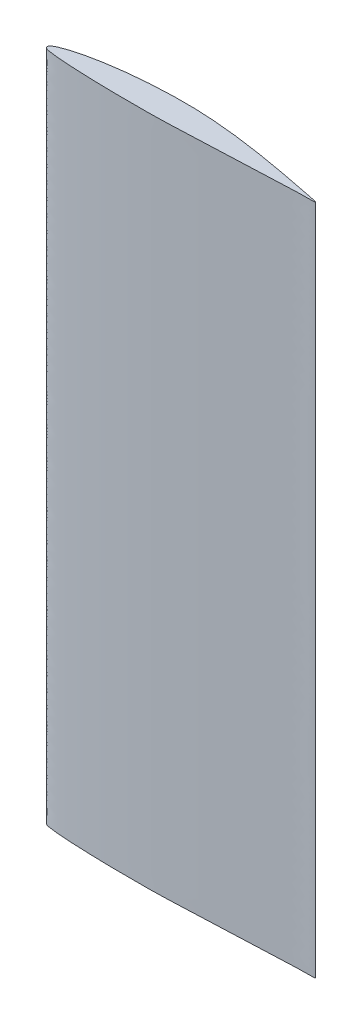
ISO-10303-21;
HEADER;
FILE_DESCRIPTION(('STEP AP214'),'2;1');
FILE_NAME('part.step','',(''),(''),'','','');
FILE_SCHEMA(('AUTOMOTIVE_DESIGN { 1 0 10303 214 1 1 1 1 }'));
ENDSEC;
DATA;
#1=APPLICATION_CONTEXT('core data for automotive mechanical design processes');
#2=APPLICATION_PROTOCOL_DEFINITION('international standard','automotive_design',2000,#1);
#3=PRODUCT_CONTEXT('',#1,'mechanical');
#4=PRODUCT('Part','Part','',(#3));
#5=PRODUCT_RELATED_PRODUCT_CATEGORY('part','',(#4));
#6=PRODUCT_DEFINITION_FORMATION('','',#4);
#7=PRODUCT_DEFINITION_CONTEXT('part definition',#1,'design');
#8=PRODUCT_DEFINITION('design','',#6,#7);
#9=PRODUCT_DEFINITION_SHAPE('','',#8);
#10=(LENGTH_UNIT() NAMED_UNIT(*) SI_UNIT(.MILLI.,.METRE.));
#11=(NAMED_UNIT(*) PLANE_ANGLE_UNIT() SI_UNIT($,.RADIAN.));
#12=(NAMED_UNIT(*) SI_UNIT($,.STERADIAN.) SOLID_ANGLE_UNIT());
#13=UNCERTAINTY_MEASURE_WITH_UNIT(LENGTH_MEASURE(1.E-05),#10,'distance_accuracy_value','');
#14=(GEOMETRIC_REPRESENTATION_CONTEXT(3) GLOBAL_UNCERTAINTY_ASSIGNED_CONTEXT((#13)) GLOBAL_UNIT_ASSIGNED_CONTEXT((#10,
#11,#12)) REPRESENTATION_CONTEXT('',''));
#15=CARTESIAN_POINT('',(0.,0.,0.));
#16=DIRECTION('',(0.,0.,1.));
#17=DIRECTION('',(1.,0.,0.));
#18=AXIS2_PLACEMENT_3D('',#15,#16,#17);
#19=CARTESIAN_POINT('',(100.,250.,0.));
#20=CARTESIAN_POINT('',(100.026927671132,250.,-0.219433857601069));
#21=CARTESIAN_POINT('',(94.2687190448547,250.,-1.18357603877327));
#22=CARTESIAN_POINT('',(90.2782919394899,250.,-2.08318901378914));
#23=CARTESIAN_POINT('',(85.041517129227,250.,-3.07989005572289));
#24=CARTESIAN_POINT('',(80.1264082453985,250.,-3.98275907273884));
#25=CARTESIAN_POINT('',(75.1120082774222,250.,-4.83259453247245));
#26=CARTESIAN_POINT('',(70.1110658354599,250.,-5.59956251336753));
#27=CARTESIAN_POINT('',(65.0940438797978,250.,-6.27264917857508));
#28=CARTESIAN_POINT('',(60.0707728010257,250.,-6.84345968217377));
#29=CARTESIAN_POINT('',(55.0395570271188,250.,-7.28990546178536));
#30=CARTESIAN_POINT('',(50.0026353208611,250.,-7.60018144206823));
#31=CARTESIAN_POINT('',(44.960674036922,250.,-7.72587288156002));
#32=CARTESIAN_POINT('',(39.9180143164161,250.,-7.69808521851061));
#33=CARTESIAN_POINT('',(34.8760374997964,250.,-7.51900318716417));
#34=CARTESIAN_POINT('',(29.8353494819684,250.,-7.21014032865744));
#35=CARTESIAN_POINT('',(24.7966077140941,250.,-6.76243725223212));
#36=CARTESIAN_POINT('',(19.7625076817131,250.,-6.15353517960491));
#37=CARTESIAN_POINT('',(14.7310618329927,250.,-5.37613055548835));
#38=CARTESIAN_POINT('',(9.70673162057761,250.,-4.36404729801727));
#39=CARTESIAN_POINT('',(5.52922086782099,250.,-3.27399749030539));
#40=CARTESIAN_POINT('',(2.65716322291705,250.,-2.20925264672238));
#41=CARTESIAN_POINT('',(1.26389952803015,250.,-1.57618033074622));
#42=CARTESIAN_POINT('',(0.635088126379829,250.,-1.14970261769804));
#43=CARTESIAN_POINT('',(0.180823596335757,250.,-0.758118253580851));
#44=CARTESIAN_POINT('',(-0.251357417409329,250.,0.0536982077151376));
#45=CARTESIAN_POINT('',(0.472849838761541,250.,0.563654735795677));
#46=CARTESIAN_POINT('',(1.00190869405862,250.,0.773847466142884));
#47=CARTESIAN_POINT('',(1.69451689374878,250.,0.954370998278404));
#48=CARTESIAN_POINT('',(3.13764553369681,250.,1.15291763324958));
#49=CARTESIAN_POINT('',(5.24459079259245,250.,1.38551365784962));
#50=CARTESIAN_POINT('',(7.75911696803287,250.,1.57850406170493));
#51=CARTESIAN_POINT('',(11.0916595399467,250.,1.79517691489934));
#52=CARTESIAN_POINT('',(15.2472114236061,250.,1.98319208588348));
#53=CARTESIAN_POINT('',(20.224881617593,250.,2.15684962290712));
#54=CARTESIAN_POINT('',(25.194649087253,250.,2.26881001014293));
#55=CARTESIAN_POINT('',(31.8122150760426,250.,2.35675664141578));
#56=CARTESIAN_POINT('',(38.4273418798502,250.,2.35472498491023));
#57=CARTESIAN_POINT('',(46.6975695156845,250.,2.21593206805948));
#58=CARTESIAN_POINT('',(53.3119366539603,250.,1.88296974154404));
#59=CARTESIAN_POINT('',(59.9356266936685,250.,1.62522224566525));
#60=CARTESIAN_POINT('',(64.9117703433052,250.,1.42126340895399));
#61=CARTESIAN_POINT('',(69.8977511827702,250.,1.22014608270236));
#62=CARTESIAN_POINT('',(74.8865230218986,250.,1.01702965608465));
#63=CARTESIAN_POINT('',(79.9087242718411,250.,0.816125999301938));
#64=CARTESIAN_POINT('',(84.8534896606434,250.,0.606576665018989));
#65=CARTESIAN_POINT('',(90.1377854676765,250.,0.426514526272728));
#66=CARTESIAN_POINT('',(94.1980625832089,250.,0.134726969093298));
#67=CARTESIAN_POINT('',(99.9733041124538,250.,0.217545050873828));
#68=CARTESIAN_POINT('',(100.,250.,0.));
#69=B_SPLINE_CURVE_WITH_KNOTS('',3,(#19,#20,#21,#22,#23,#24,#25,#26,#27,#28,#29,#30,#31,#32,#33,
#34,#35,#36,#37,#38,#39,#40,#41,#42,#43,#44,#45,#46,#47,#48,#49,#50,#51,#52,#53,#54,#55,#56,#57,
#58,#59,#60,#61,#62,#63,#64,#65,#66,#67,#68),.UNSPECIFIED.,.T.,.F.,(4,1,1,1,1,1,1,1,1,1,1,1,1,1,
1,1,1,1,1,1,1,1,1,1,1,1,1,1,1,1,1,1,1,1,1,1,1,1,1,1,1,1,1,1,1,1,1,4),(0.,0.0250986036707922,
0.0501103077754413,0.0751313716599332,0.100155101425005,0.125174498414434,0.150180025168701,
0.175165489812754,0.200126912172281,0.225061593791551,0.249970909716482,0.274861188741395,
0.299750368383722,0.324652268168195,0.34957928738967,0.374544440011454,0.399567460672877,
0.424676220232209,0.449929949559326,0.475469786734528,0.488517682300722,0.49525112955107,
0.498115346933743,0.499656140721362,0.504317403180702,0.508820397070985,0.510252972736085,
0.512928795668195,0.519316537562298,0.531865302668312,0.544297815356915,0.556674285233447,
0.581327679140725,0.605908743298428,0.630446609387428,0.654955942764506,0.703934737355844,
0.728422960879711,0.777461819335971,0.802016770600372,0.826605821111039,0.851234377428534,
0.87590891271877,0.900632840261499,0.925408666650652,0.95023834518805,0.97511743596856,1.),.UNSPECIFIED.);
#70=DIRECTION('',(0.,-1.,0.));
#71=VECTOR('',#70,1.);
#72=SURFACE_OF_LINEAR_EXTRUSION('',#69,#71);
#73=CARTESIAN_POINT('',(100.,250.,0.));
#74=VERTEX_POINT('',#73);
#75=EDGE_CURVE('E10',#74,#74,#69,.T.);
#76=ORIENTED_EDGE('',*,*,#75,.F.);
#77=EDGE_LOOP('',(#76));
#78=FACE_BOUND('',#77,.T.);
#79=CARTESIAN_POINT('',(100.,0.,0.));
#80=CARTESIAN_POINT('',(100.026927671132,0.,-0.219433857601069));
#81=CARTESIAN_POINT('',(94.2687190448547,0.,-1.18357603877327));
#82=CARTESIAN_POINT('',(90.2782919394899,0.,-2.08318901378914));
#83=CARTESIAN_POINT('',(85.041517129227,0.,-3.07989005572289));
#84=CARTESIAN_POINT('',(80.1264082453985,0.,-3.98275907273884));
#85=CARTESIAN_POINT('',(75.1120082774222,0.,-4.83259453247245));
#86=CARTESIAN_POINT('',(70.1110658354599,0.,-5.59956251336753));
#87=CARTESIAN_POINT('',(65.0940438797978,0.,-6.27264917857508));
#88=CARTESIAN_POINT('',(60.0707728010257,0.,-6.84345968217377));
#89=CARTESIAN_POINT('',(55.0395570271188,0.,-7.28990546178536));
#90=CARTESIAN_POINT('',(50.0026353208611,0.,-7.60018144206823));
#91=CARTESIAN_POINT('',(44.960674036922,0.,-7.72587288156002));
#92=CARTESIAN_POINT('',(39.9180143164161,0.,-7.69808521851061));
#93=CARTESIAN_POINT('',(34.8760374997964,0.,-7.51900318716417));
#94=CARTESIAN_POINT('',(29.8353494819684,0.,-7.21014032865744));
#95=CARTESIAN_POINT('',(24.7966077140941,0.,-6.76243725223212));
#96=CARTESIAN_POINT('',(19.7625076817131,0.,-6.15353517960491));
#97=CARTESIAN_POINT('',(14.7310618329927,0.,-5.37613055548835));
#98=CARTESIAN_POINT('',(9.70673162057761,0.,-4.36404729801727));
#99=CARTESIAN_POINT('',(5.52922086782099,0.,-3.27399749030539));
#100=CARTESIAN_POINT('',(2.65716322291705,0.,-2.20925264672238));
#101=CARTESIAN_POINT('',(1.26389952803015,0.,-1.57618033074622));
#102=CARTESIAN_POINT('',(0.635088126379829,0.,-1.14970261769804));
#103=CARTESIAN_POINT('',(0.180823596335757,0.,-0.758118253580851));
#104=CARTESIAN_POINT('',(-0.251357417409329,0.,0.0536982077151376));
#105=CARTESIAN_POINT('',(0.472849838761541,0.,0.563654735795677));
#106=CARTESIAN_POINT('',(1.00190869405862,0.,0.773847466142884));
#107=CARTESIAN_POINT('',(1.69451689374878,0.,0.954370998278404));
#108=CARTESIAN_POINT('',(3.13764553369681,0.,1.15291763324958));
#109=CARTESIAN_POINT('',(5.24459079259245,0.,1.38551365784962));
#110=CARTESIAN_POINT('',(7.75911696803287,0.,1.57850406170493));
#111=CARTESIAN_POINT('',(11.0916595399467,0.,1.79517691489934));
#112=CARTESIAN_POINT('',(15.2472114236061,0.,1.98319208588348));
#113=CARTESIAN_POINT('',(20.224881617593,0.,2.15684962290712));
#114=CARTESIAN_POINT('',(25.194649087253,0.,2.26881001014293));
#115=CARTESIAN_POINT('',(31.8122150760426,0.,2.35675664141578));
#116=CARTESIAN_POINT('',(38.4273418798502,0.,2.35472498491023));
#117=CARTESIAN_POINT('',(46.6975695156845,0.,2.21593206805948));
#118=CARTESIAN_POINT('',(53.3119366539603,0.,1.88296974154404));
#119=CARTESIAN_POINT('',(59.9356266936685,0.,1.62522224566525));
#120=CARTESIAN_POINT('',(64.9117703433052,0.,1.42126340895399));
#121=CARTESIAN_POINT('',(69.8977511827702,0.,1.22014608270236));
#122=CARTESIAN_POINT('',(74.8865230218986,0.,1.01702965608465));
#123=CARTESIAN_POINT('',(79.9087242718411,0.,0.816125999301938));
#124=CARTESIAN_POINT('',(84.8534896606434,0.,0.606576665018989));
#125=CARTESIAN_POINT('',(90.1377854676765,0.,0.426514526272728));
#126=CARTESIAN_POINT('',(94.1980625832089,0.,0.134726969093298));
#127=CARTESIAN_POINT('',(99.9733041124538,0.,0.217545050873828));
#128=CARTESIAN_POINT('',(100.,0.,0.));
#129=B_SPLINE_CURVE_WITH_KNOTS('',3,(#79,#80,#81,#82,#83,#84,#85,#86,#87,#88,#89,#90,#91,#92,
#93,#94,#95,#96,#97,#98,#99,#100,#101,#102,#103,#104,#105,#106,#107,#108,#109,#110,#111,#112,
#113,#114,#115,#116,#117,#118,#119,#120,#121,#122,#123,#124,#125,#126,#127,#128),.UNSPECIFIED.,
.T.,.F.,(4,1,1,1,1,1,1,1,1,1,1,1,1,1,1,1,1,1,1,1,1,1,1,1,1,1,1,1,1,1,1,1,1,1,1,1,1,1,1,1,1,1,1,
1,1,1,1,4),(0.,0.0250986036707922,0.0501103077754413,0.0751313716599332,0.100155101425005,
0.125174498414434,0.150180025168701,0.175165489812754,0.200126912172281,0.225061593791551,
0.249970909716482,0.274861188741395,0.299750368383722,0.324652268168195,0.34957928738967,
0.374544440011454,0.399567460672877,0.424676220232209,0.449929949559326,0.475469786734528,
0.488517682300722,0.49525112955107,0.498115346933743,0.499656140721362,0.504317403180702,
0.508820397070985,0.510252972736085,0.512928795668195,0.519316537562298,0.531865302668312,
0.544297815356915,0.556674285233447,0.581327679140725,0.605908743298428,0.630446609387428,
0.654955942764506,0.703934737355844,0.728422960879711,0.777461819335971,0.802016770600372,
0.826605821111039,0.851234377428534,0.87590891271877,0.900632840261499,0.925408666650652,
0.95023834518805,0.97511743596856,1.),.UNSPECIFIED.);
#130=CARTESIAN_POINT('',(100.,0.,0.));
#131=VERTEX_POINT('',#130);
#132=EDGE_CURVE('E35',#131,#131,#129,.T.);
#133=ORIENTED_EDGE('',*,*,#132,.T.);
#134=EDGE_LOOP('',(#133));
#135=FACE_BOUND('',#134,.T.);
#136=ADVANCED_FACE('F31',(#78,#135),#72,.F.);
#137=CARTESIAN_POINT('',(0.292353775907858,250.,-0.825684247843309));
#138=DIRECTION('',(0.,-1.,0.));
#139=DIRECTION('',(0.,0.,-1.));
#140=AXIS2_PLACEMENT_3D('',#137,#138,#139);
#141=PLANE('',#140);
#142=ORIENTED_EDGE('',*,*,#75,.T.);
#143=EDGE_LOOP('',(#142));
#144=FACE_BOUND('',#143,.T.);
#145=ADVANCED_FACE('F54',(#144),#141,.F.);
#146=CARTESIAN_POINT('',(0.292353775907858,0.,-0.825684247843309));
#147=DIRECTION('',(0.,-1.,0.));
#148=DIRECTION('',(0.,0.,-1.));
#149=AXIS2_PLACEMENT_3D('',#146,#147,#148);
#150=PLANE('',#149);
#151=ORIENTED_EDGE('',*,*,#132,.F.);
#152=EDGE_LOOP('',(#151));
#153=FACE_BOUND('',#152,.T.);
#154=ADVANCED_FACE('F52',(#153),#150,.T.);
#155=CLOSED_SHELL('',(#136,#145,#154));
#156=MANIFOLD_SOLID_BREP('B2',#155);
#157=ADVANCED_BREP_SHAPE_REPRESENTATION('',(#18,#156),#14);
#158=SHAPE_DEFINITION_REPRESENTATION(#9,#157);
ENDSEC;
END-ISO-10303-21;
